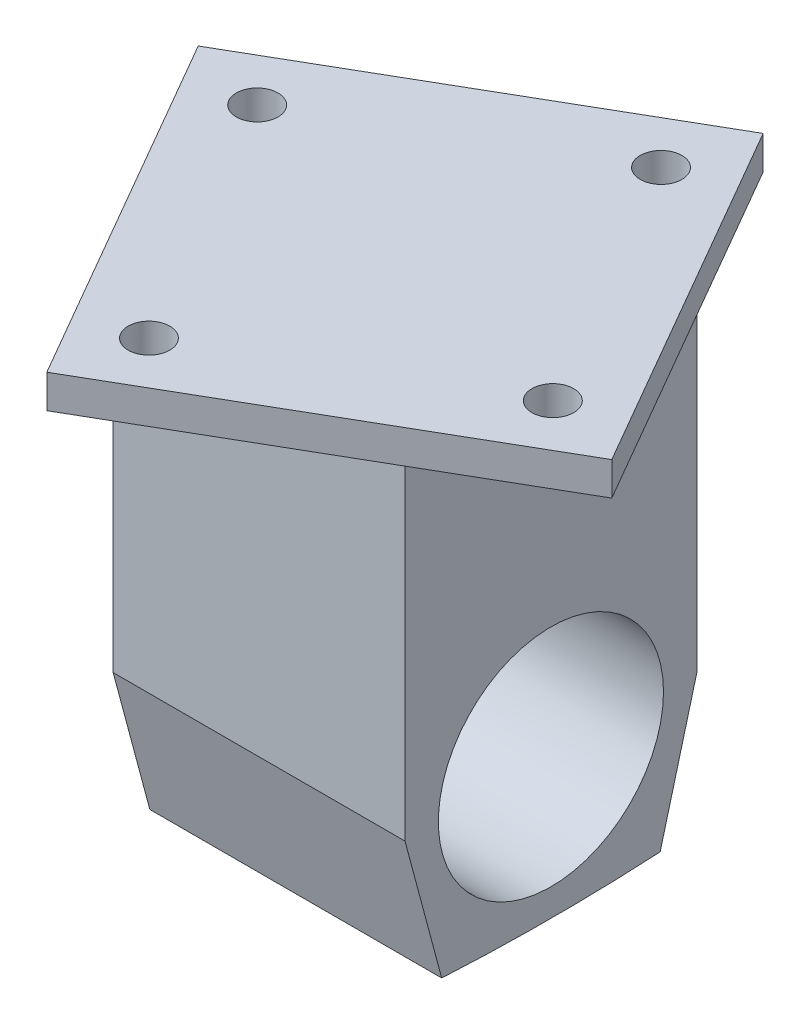
ISO-10303-21;
HEADER;
FILE_DESCRIPTION(('STEP AP214'),'2;1');
FILE_NAME('part.step','',(''),(''),'','','');
FILE_SCHEMA(('AUTOMOTIVE_DESIGN { 1 0 10303 214 1 1 1 1 }'));
ENDSEC;
DATA;
#1=APPLICATION_CONTEXT('core data for automotive mechanical design processes');
#2=APPLICATION_PROTOCOL_DEFINITION('international standard','automotive_design',2000,#1);
#3=PRODUCT_CONTEXT('',#1,'mechanical');
#4=PRODUCT('Part','Part','',(#3));
#5=PRODUCT_RELATED_PRODUCT_CATEGORY('part','',(#4));
#6=PRODUCT_DEFINITION_FORMATION('','',#4);
#7=PRODUCT_DEFINITION_CONTEXT('part definition',#1,'design');
#8=PRODUCT_DEFINITION('design','',#6,#7);
#9=PRODUCT_DEFINITION_SHAPE('','',#8);
#10=(LENGTH_UNIT() NAMED_UNIT(*) SI_UNIT(.MILLI.,.METRE.));
#11=(NAMED_UNIT(*) PLANE_ANGLE_UNIT() SI_UNIT($,.RADIAN.));
#12=(NAMED_UNIT(*) SI_UNIT($,.STERADIAN.) SOLID_ANGLE_UNIT());
#13=UNCERTAINTY_MEASURE_WITH_UNIT(LENGTH_MEASURE(1.E-05),#10,'distance_accuracy_value','');
#14=(GEOMETRIC_REPRESENTATION_CONTEXT(3) GLOBAL_UNCERTAINTY_ASSIGNED_CONTEXT((#13)) GLOBAL_UNIT_ASSIGNED_CONTEXT((#10,
#11,#12)) REPRESENTATION_CONTEXT('',''));
#15=CARTESIAN_POINT('',(0.,0.,0.));
#16=DIRECTION('',(0.,0.,1.));
#17=DIRECTION('',(1.,0.,0.));
#18=AXIS2_PLACEMENT_3D('',#15,#16,#17);
#19=CARTESIAN_POINT('',(22.225,50.292,22.225));
#20=DIRECTION('',(-1.,0.,0.));
#21=DIRECTION('',(0.,0.,1.));
#22=AXIS2_PLACEMENT_3D('',#19,#20,#21);
#23=PLANE('',#22);
#24=CARTESIAN_POINT('',(22.225,0.,0.));
#25=DIRECTION('',(1.,0.,0.));
#26=DIRECTION('',(0.,0.,-1.));
#27=AXIS2_PLACEMENT_3D('',#24,#25,#26);
#28=CIRCLE('',#27,17.145);
#29=CARTESIAN_POINT('',(22.225,0.,-17.145));
#30=VERTEX_POINT('',#29);
#31=EDGE_CURVE('E132',#30,#30,#28,.T.);
#32=ORIENTED_EDGE('',*,*,#31,.F.);
#33=EDGE_LOOP('',(#32));
#34=FACE_BOUND('',#33,.T.);
#35=DIRECTION('',(0.,-1.,0.));
#36=VECTOR('',#35,1.);
#37=CARTESIAN_POINT('',(22.225,50.292,22.225));
#38=LINE('',#37,#36);
#39=CARTESIAN_POINT('',(22.225,50.292,22.225));
#40=VERTEX_POINT('',#39);
#41=CARTESIAN_POINT('',(22.225,0.,22.225));
#42=VERTEX_POINT('',#41);
#43=EDGE_CURVE('E175',#40,#42,#38,.T.);
#44=ORIENTED_EDGE('',*,*,#43,.T.);
#45=DIRECTION('',(0.,-0.965925826289069,-0.258819045102518));
#46=VECTOR('',#45,1.);
#47=CARTESIAN_POINT('',(22.225,0.,22.225));
#48=LINE('',#47,#46);
#49=CARTESIAN_POINT('',(22.225,-20.854338589581,16.6370968162366));
#50=VERTEX_POINT('',#49);
#51=EDGE_CURVE('E144',#42,#50,#48,.T.);
#52=ORIENTED_EDGE('',*,*,#51,.T.);
#53=CARTESIAN_POINT('',(22.225,278.671939216944,4.44089209850063E-13));
#54=DIRECTION('',(-1.,0.,0.));
#55=DIRECTION('',(0.,0.,1.));
#56=AXIS2_PLACEMENT_3D('',#53,#54,#55);
#57=CIRCLE('',#56,299.987973237435);
#58=CARTESIAN_POINT('',(22.225,-20.854338589581,-16.6370968162367));
#59=VERTEX_POINT('',#58);
#60=EDGE_CURVE('E152',#59,#50,#57,.T.);
#61=ORIENTED_EDGE('',*,*,#60,.F.);
#62=DIRECTION('',(0.,-0.965925826289067,0.258819045102525));
#63=VECTOR('',#62,1.);
#64=CARTESIAN_POINT('',(22.225,0.,-22.225));
#65=LINE('',#64,#63);
#66=CARTESIAN_POINT('',(22.225,0.,-22.225));
#67=VERTEX_POINT('',#66);
#68=EDGE_CURVE('E150',#67,#59,#65,.T.);
#69=ORIENTED_EDGE('',*,*,#68,.F.);
#70=DIRECTION('',(0.,-1.,0.));
#71=VECTOR('',#70,1.);
#72=CARTESIAN_POINT('',(22.225,50.292,-22.225));
#73=LINE('',#72,#71);
#74=CARTESIAN_POINT('',(22.225,50.292,-22.225));
#75=VERTEX_POINT('',#74);
#76=EDGE_CURVE('E11',#75,#67,#73,.T.);
#77=ORIENTED_EDGE('',*,*,#76,.F.);
#78=DIRECTION('',(0.,0.,-1.));
#79=VECTOR('',#78,1.);
#80=CARTESIAN_POINT('',(22.225,50.292,22.225));
#81=LINE('',#80,#79);
#82=EDGE_CURVE('E162',#40,#75,#81,.T.);
#83=ORIENTED_EDGE('',*,*,#82,.F.);
#84=EDGE_LOOP('',(#44,#52,#61,#69,#77,#83));
#85=FACE_BOUND('',#84,.T.);
#86=ADVANCED_FACE('F32',(#34,#85),#23,.F.);
#87=CARTESIAN_POINT('',(-22.225,50.292,-22.225));
#88=DIRECTION('',(0.,0.,1.));
#89=DIRECTION('',(1.,0.,0.));
#90=AXIS2_PLACEMENT_3D('',#87,#88,#89);
#91=PLANE('',#90);
#92=DIRECTION('',(-1.,0.,0.));
#93=VECTOR('',#92,1.);
#94=CARTESIAN_POINT('',(-22.225,0.,-22.225));
#95=LINE('',#94,#93);
#96=CARTESIAN_POINT('',(-22.225,0.,-22.225));
#97=VERTEX_POINT('',#96);
#98=EDGE_CURVE('E161',#67,#97,#95,.T.);
#99=ORIENTED_EDGE('',*,*,#98,.T.);
#100=DIRECTION('',(0.,-1.,0.));
#101=VECTOR('',#100,1.);
#102=CARTESIAN_POINT('',(-22.225,50.292,-22.225));
#103=LINE('',#102,#101);
#104=CARTESIAN_POINT('',(-22.225,50.292,-22.225));
#105=VERTEX_POINT('',#104);
#106=EDGE_CURVE('E41',#105,#97,#103,.T.);
#107=ORIENTED_EDGE('',*,*,#106,.F.);
#108=DIRECTION('',(-1.,0.,0.));
#109=VECTOR('',#108,1.);
#110=CARTESIAN_POINT('',(-22.225,50.292,-22.225));
#111=LINE('',#110,#109);
#112=EDGE_CURVE('E165',#75,#105,#111,.T.);
#113=ORIENTED_EDGE('',*,*,#112,.F.);
#114=ORIENTED_EDGE('',*,*,#76,.T.);
#115=EDGE_LOOP('',(#99,#107,#113,#114));
#116=FACE_BOUND('',#115,.T.);
#117=ADVANCED_FACE('F259',(#116),#91,.F.);
#118=CARTESIAN_POINT('',(-22.225,50.292,22.225));
#119=DIRECTION('',(1.,0.,0.));
#120=DIRECTION('',(0.,0.,-1.));
#121=AXIS2_PLACEMENT_3D('',#118,#119,#120);
#122=PLANE('',#121);
#123=CARTESIAN_POINT('',(-22.225,0.,0.));
#124=DIRECTION('',(1.,0.,0.));
#125=DIRECTION('',(0.,0.,-1.));
#126=AXIS2_PLACEMENT_3D('',#123,#124,#125);
#127=CIRCLE('',#126,17.145);
#128=CARTESIAN_POINT('',(-22.225,0.,-17.145));
#129=VERTEX_POINT('',#128);
#130=EDGE_CURVE('E135',#129,#129,#127,.T.);
#131=ORIENTED_EDGE('',*,*,#130,.T.);
#132=EDGE_LOOP('',(#131));
#133=FACE_BOUND('',#132,.T.);
#134=ORIENTED_EDGE('',*,*,#106,.T.);
#135=DIRECTION('',(0.,-0.965925826289067,0.258819045102525));
#136=VECTOR('',#135,1.);
#137=CARTESIAN_POINT('',(-22.225,0.,-22.225));
#138=LINE('',#137,#136);
#139=CARTESIAN_POINT('',(-22.225,-20.854338589581,-16.6370968162367));
#140=VERTEX_POINT('',#139);
#141=EDGE_CURVE('E141',#97,#140,#138,.T.);
#142=ORIENTED_EDGE('',*,*,#141,.T.);
#143=CARTESIAN_POINT('',(-22.225,278.671939216944,4.44089209850063E-13));
#144=DIRECTION('',(-1.,0.,0.));
#145=DIRECTION('',(0.,0.,1.));
#146=AXIS2_PLACEMENT_3D('',#143,#144,#145);
#147=CIRCLE('',#146,299.987973237435);
#148=CARTESIAN_POINT('',(-22.225,-20.854338589581,16.6370968162366));
#149=VERTEX_POINT('',#148);
#150=EDGE_CURVE('E143',#140,#149,#147,.T.);
#151=ORIENTED_EDGE('',*,*,#150,.T.);
#152=DIRECTION('',(0.,-0.965925826289069,-0.258819045102518));
#153=VECTOR('',#152,1.);
#154=CARTESIAN_POINT('',(-22.225,0.,22.225));
#155=LINE('',#154,#153);
#156=CARTESIAN_POINT('',(-22.225,0.,22.225));
#157=VERTEX_POINT('',#156);
#158=EDGE_CURVE('E146',#157,#149,#155,.T.);
#159=ORIENTED_EDGE('',*,*,#158,.F.);
#160=DIRECTION('',(0.,-1.,0.));
#161=VECTOR('',#160,1.);
#162=CARTESIAN_POINT('',(-22.225,50.292,22.225));
#163=LINE('',#162,#161);
#164=CARTESIAN_POINT('',(-22.225,50.292,22.225));
#165=VERTEX_POINT('',#164);
#166=EDGE_CURVE('E49',#165,#157,#163,.T.);
#167=ORIENTED_EDGE('',*,*,#166,.F.);
#168=DIRECTION('',(0.,0.,1.));
#169=VECTOR('',#168,1.);
#170=CARTESIAN_POINT('',(-22.225,50.292,22.225));
#171=LINE('',#170,#169);
#172=EDGE_CURVE('E169',#105,#165,#171,.T.);
#173=ORIENTED_EDGE('',*,*,#172,.F.);
#174=EDGE_LOOP('',(#134,#142,#151,#159,#167,#173));
#175=FACE_BOUND('',#174,.T.);
#176=ADVANCED_FACE('F264',(#133,#175),#122,.F.);
#177=CARTESIAN_POINT('',(-22.225,50.292,22.225));
#178=DIRECTION('',(0.,0.,-1.));
#179=DIRECTION('',(-1.,0.,0.));
#180=AXIS2_PLACEMENT_3D('',#177,#178,#179);
#181=PLANE('',#180);
#182=DIRECTION('',(1.,0.,0.));
#183=VECTOR('',#182,1.);
#184=CARTESIAN_POINT('',(-22.225,0.,22.225));
#185=LINE('',#184,#183);
#186=EDGE_CURVE('E166',#157,#42,#185,.T.);
#187=ORIENTED_EDGE('',*,*,#186,.T.);
#188=ORIENTED_EDGE('',*,*,#43,.F.);
#189=DIRECTION('',(1.,0.,0.));
#190=VECTOR('',#189,1.);
#191=CARTESIAN_POINT('',(-22.225,50.292,22.225));
#192=LINE('',#191,#190);
#193=EDGE_CURVE('E172',#165,#40,#192,.T.);
#194=ORIENTED_EDGE('',*,*,#193,.F.);
#195=ORIENTED_EDGE('',*,*,#166,.T.);
#196=EDGE_LOOP('',(#187,#188,#194,#195));
#197=FACE_BOUND('',#196,.T.);
#198=ADVANCED_FACE('F272',(#197),#181,.F.);
#199=CARTESIAN_POINT('',(-22.225,0.,-22.225));
#200=DIRECTION('',(0.,0.258819045102525,0.965925826289067));
#201=DIRECTION('',(0.,-0.965925826289067,0.258819045102525));
#202=AXIS2_PLACEMENT_3D('',#199,#200,#201);
#203=PLANE('',#202);
#204=ORIENTED_EDGE('',*,*,#68,.T.);
#205=DIRECTION('',(1.,0.,0.));
#206=VECTOR('',#205,1.);
#207=CARTESIAN_POINT('',(-22.225,-20.854338589581,-16.6370968162367));
#208=LINE('',#207,#206);
#209=EDGE_CURVE('E158',#140,#59,#208,.T.);
#210=ORIENTED_EDGE('',*,*,#209,.F.);
#211=ORIENTED_EDGE('',*,*,#141,.F.);
#212=ORIENTED_EDGE('',*,*,#98,.F.);
#213=EDGE_LOOP('',(#204,#210,#211,#212));
#214=FACE_BOUND('',#213,.T.);
#215=ADVANCED_FACE('F278',(#214),#203,.F.);
#216=CARTESIAN_POINT('',(-22.225,278.671939216944,4.44089209850063E-13));
#217=DIRECTION('',(1.,0.,0.));
#218=DIRECTION('',(0.,0.,-1.));
#219=AXIS2_PLACEMENT_3D('',#216,#217,#218);
#220=CYLINDRICAL_SURFACE('',#219,299.987973237435);
#221=ORIENTED_EDGE('',*,*,#60,.T.);
#222=DIRECTION('',(1.,0.,0.));
#223=VECTOR('',#222,1.);
#224=CARTESIAN_POINT('',(-22.225,-20.854338589581,16.6370968162366));
#225=LINE('',#224,#223);
#226=EDGE_CURVE('E149',#149,#50,#225,.T.);
#227=ORIENTED_EDGE('',*,*,#226,.F.);
#228=ORIENTED_EDGE('',*,*,#150,.F.);
#229=ORIENTED_EDGE('',*,*,#209,.T.);
#230=EDGE_LOOP('',(#221,#227,#228,#229));
#231=FACE_BOUND('',#230,.T.);
#232=ADVANCED_FACE('F282',(#231),#220,.T.);
#233=CARTESIAN_POINT('',(-22.225,0.,22.225));
#234=DIRECTION('',(0.,-0.258819045102518,0.965925826289069));
#235=DIRECTION('',(0.,-0.965925826289069,-0.258819045102518));
#236=AXIS2_PLACEMENT_3D('',#233,#234,#235);
#237=PLANE('',#236);
#238=ORIENTED_EDGE('',*,*,#51,.F.);
#239=ORIENTED_EDGE('',*,*,#186,.F.);
#240=ORIENTED_EDGE('',*,*,#158,.T.);
#241=ORIENTED_EDGE('',*,*,#226,.T.);
#242=EDGE_LOOP('',(#238,#239,#240,#241));
#243=FACE_BOUND('',#242,.T.);
#244=ADVANCED_FACE('F284',(#243),#237,.T.);
#245=CARTESIAN_POINT('',(-104.775,0.,0.));
#246=DIRECTION('',(1.,0.,0.));
#247=DIRECTION('',(0.,0.,-1.));
#248=AXIS2_PLACEMENT_3D('',#245,#246,#247);
#249=CYLINDRICAL_SURFACE('',#248,17.145);
#250=ORIENTED_EDGE('',*,*,#31,.T.);
#251=EDGE_LOOP('',(#250));
#252=FACE_BOUND('',#251,.T.);
#253=ORIENTED_EDGE('',*,*,#130,.F.);
#254=EDGE_LOOP('',(#253));
#255=FACE_BOUND('',#254,.T.);
#256=ADVANCED_FACE('F286',(#252,#255),#249,.F.);
#257=CARTESIAN_POINT('',(11.5283361175947,55.372,-43.0243361175947));
#258=DIRECTION('',(-0.866025403784439,0.,0.5));
#259=DIRECTION('',(0.5,0.,0.866025403784439));
#260=AXIS2_PLACEMENT_3D('',#257,#258,#259);
#261=PLANE('',#260);
#262=DIRECTION('',(-0.5,0.,-0.866025403784439));
#263=VECTOR('',#262,1.);
#264=CARTESIAN_POINT('',(11.5283361175947,50.292,-43.0243361175947));
#265=LINE('',#264,#263);
#266=CARTESIAN_POINT('',(43.0243361175947,50.292,11.5283361175947));
#267=VERTEX_POINT('',#266);
#268=CARTESIAN_POINT('',(11.5283361175947,50.292,-43.0243361175947));
#269=VERTEX_POINT('',#268);
#270=EDGE_CURVE('E131',#267,#269,#265,.T.);
#271=ORIENTED_EDGE('',*,*,#270,.T.);
#272=DIRECTION('',(0.,-1.,0.));
#273=VECTOR('',#272,1.);
#274=CARTESIAN_POINT('',(11.5283361175947,55.372,-43.0243361175947));
#275=LINE('',#274,#273);
#276=CARTESIAN_POINT('',(11.5283361175947,55.372,-43.0243361175947));
#277=VERTEX_POINT('',#276);
#278=EDGE_CURVE('E111',#277,#269,#275,.T.);
#279=ORIENTED_EDGE('',*,*,#278,.F.);
#280=DIRECTION('',(-0.5,0.,-0.866025403784439));
#281=VECTOR('',#280,1.);
#282=CARTESIAN_POINT('',(11.5283361175947,55.372,-43.0243361175947));
#283=LINE('',#282,#281);
#284=CARTESIAN_POINT('',(43.0243361175947,55.372,11.5283361175947));
#285=VERTEX_POINT('',#284);
#286=EDGE_CURVE('E118',#285,#277,#283,.T.);
#287=ORIENTED_EDGE('',*,*,#286,.F.);
#288=DIRECTION('',(0.,-1.,0.));
#289=VECTOR('',#288,1.);
#290=CARTESIAN_POINT('',(43.0243361175947,55.372,11.5283361175947));
#291=LINE('',#290,#289);
#292=EDGE_CURVE('E209',#285,#267,#291,.T.);
#293=ORIENTED_EDGE('',*,*,#292,.T.);
#294=EDGE_LOOP('',(#271,#279,#287,#293));
#295=FACE_BOUND('',#294,.T.);
#296=ADVANCED_FACE('F129',(#295),#261,.F.);
#297=CARTESIAN_POINT('',(-43.0243361175947,55.372,-11.5283361175947));
#298=DIRECTION('',(0.5,0.,0.866025403784439));
#299=DIRECTION('',(0.866025403784439,0.,-0.5));
#300=AXIS2_PLACEMENT_3D('',#297,#298,#299);
#301=PLANE('',#300);
#302=DIRECTION('',(-0.866025403784439,0.,0.5));
#303=VECTOR('',#302,1.);
#304=CARTESIAN_POINT('',(-43.0243361175947,50.292,-11.5283361175947));
#305=LINE('',#304,#303);
#306=CARTESIAN_POINT('',(-43.0243361175947,50.292,-11.5283361175947));
#307=VERTEX_POINT('',#306);
#308=EDGE_CURVE('E200',#269,#307,#305,.T.);
#309=ORIENTED_EDGE('',*,*,#308,.T.);
#310=DIRECTION('',(0.,-1.,0.));
#311=VECTOR('',#310,1.);
#312=CARTESIAN_POINT('',(-43.0243361175947,55.372,-11.5283361175947));
#313=LINE('',#312,#311);
#314=CARTESIAN_POINT('',(-43.0243361175947,55.372,-11.5283361175947));
#315=VERTEX_POINT('',#314);
#316=EDGE_CURVE('E114',#315,#307,#313,.T.);
#317=ORIENTED_EDGE('',*,*,#316,.F.);
#318=DIRECTION('',(-0.866025403784439,0.,0.5));
#319=VECTOR('',#318,1.);
#320=CARTESIAN_POINT('',(-43.0243361175947,55.372,-11.5283361175947));
#321=LINE('',#320,#319);
#322=EDGE_CURVE('E107',#277,#315,#321,.T.);
#323=ORIENTED_EDGE('',*,*,#322,.F.);
#324=ORIENTED_EDGE('',*,*,#278,.T.);
#325=EDGE_LOOP('',(#309,#317,#323,#324));
#326=FACE_BOUND('',#325,.T.);
#327=ADVANCED_FACE('F109',(#326),#301,.F.);
#328=CARTESIAN_POINT('',(-11.5283361175947,55.372,43.0243361175947));
#329=DIRECTION('',(0.866025403784439,0.,-0.5));
#330=DIRECTION('',(-0.5,0.,-0.866025403784439));
#331=AXIS2_PLACEMENT_3D('',#328,#329,#330);
#332=PLANE('',#331);
#333=DIRECTION('',(0.5,0.,0.866025403784439));
#334=VECTOR('',#333,1.);
#335=CARTESIAN_POINT('',(-11.5283361175947,50.292,43.0243361175947));
#336=LINE('',#335,#334);
#337=CARTESIAN_POINT('',(-11.5283361175947,50.292,43.0243361175947));
#338=VERTEX_POINT('',#337);
#339=EDGE_CURVE('E202',#307,#338,#336,.T.);
#340=ORIENTED_EDGE('',*,*,#339,.T.);
#341=DIRECTION('',(0.,-1.,0.));
#342=VECTOR('',#341,1.);
#343=CARTESIAN_POINT('',(-11.5283361175947,55.372,43.0243361175947));
#344=LINE('',#343,#342);
#345=CARTESIAN_POINT('',(-11.5283361175947,55.372,43.0243361175947));
#346=VERTEX_POINT('',#345);
#347=EDGE_CURVE('E137',#346,#338,#344,.T.);
#348=ORIENTED_EDGE('',*,*,#347,.F.);
#349=DIRECTION('',(0.5,0.,0.866025403784439));
#350=VECTOR('',#349,1.);
#351=CARTESIAN_POINT('',(-11.5283361175947,55.372,43.0243361175947));
#352=LINE('',#351,#350);
#353=EDGE_CURVE('E117',#315,#346,#352,.T.);
#354=ORIENTED_EDGE('',*,*,#353,.F.);
#355=ORIENTED_EDGE('',*,*,#316,.T.);
#356=EDGE_LOOP('',(#340,#348,#354,#355));
#357=FACE_BOUND('',#356,.T.);
#358=ADVANCED_FACE('F219',(#357),#332,.F.);
#359=CARTESIAN_POINT('',(43.0243361175947,55.372,11.5283361175947));
#360=DIRECTION('',(-0.5,0.,-0.866025403784439));
#361=DIRECTION('',(-0.866025403784439,0.,0.5));
#362=AXIS2_PLACEMENT_3D('',#359,#360,#361);
#363=PLANE('',#362);
#364=DIRECTION('',(0.866025403784439,0.,-0.5));
#365=VECTOR('',#364,1.);
#366=CARTESIAN_POINT('',(43.0243361175947,50.292,11.5283361175947));
#367=LINE('',#366,#365);
#368=EDGE_CURVE('E127',#338,#267,#367,.T.);
#369=ORIENTED_EDGE('',*,*,#368,.T.);
#370=ORIENTED_EDGE('',*,*,#292,.F.);
#371=DIRECTION('',(0.866025403784439,0.,-0.5));
#372=VECTOR('',#371,1.);
#373=CARTESIAN_POINT('',(43.0243361175947,55.372,11.5283361175947));
#374=LINE('',#373,#372);
#375=EDGE_CURVE('E123',#346,#285,#374,.T.);
#376=ORIENTED_EDGE('',*,*,#375,.F.);
#377=ORIENTED_EDGE('',*,*,#347,.T.);
#378=EDGE_LOOP('',(#369,#370,#376,#377));
#379=FACE_BOUND('',#378,.T.);
#380=ADVANCED_FACE('F214',(#379),#363,.F.);
#381=CARTESIAN_POINT('',(0.,55.372,0.));
#382=DIRECTION('',(0.,-1.,0.));
#383=DIRECTION('',(0.,0.,-1.));
#384=AXIS2_PLACEMENT_3D('',#381,#382,#383);
#385=PLANE('',#384);
#386=CARTESIAN_POINT('',(30.7570781237235,55.372,8.24133424479262));
#387=DIRECTION('',(0.,1.,0.));
#388=DIRECTION('',(0.,0.,1.));
#389=AXIS2_PLACEMENT_3D('',#386,#387,#388);
#390=CIRCLE('',#389,3.175);
#391=CARTESIAN_POINT('',(30.7570781237235,55.372,11.4163342447926));
#392=VERTEX_POINT('',#391);
#393=EDGE_CURVE('E191',#392,#392,#390,.T.);
#394=ORIENTED_EDGE('',*,*,#393,.F.);
#395=EDGE_LOOP('',(#394));
#396=FACE_BOUND('',#395,.T.);
#397=CARTESIAN_POINT('',(-8.24133424479266,55.372,30.7570781237235));
#398=DIRECTION('',(0.,1.,0.));
#399=DIRECTION('',(0.,0.,1.));
#400=AXIS2_PLACEMENT_3D('',#397,#398,#399);
#401=CIRCLE('',#400,3.175);
#402=CARTESIAN_POINT('',(-8.24133424479266,55.372,33.9320781237235));
#403=VERTEX_POINT('',#402);
#404=EDGE_CURVE('E227',#403,#403,#401,.T.);
#405=ORIENTED_EDGE('',*,*,#404,.F.);
#406=EDGE_LOOP('',(#405));
#407=FACE_BOUND('',#406,.T.);
#408=CARTESIAN_POINT('',(8.24133424479261,55.372,-30.7570781237235));
#409=DIRECTION('',(0.,1.,0.));
#410=DIRECTION('',(0.,0.,-1.));
#411=AXIS2_PLACEMENT_3D('',#408,#409,#410);
#412=CIRCLE('',#411,3.175);
#413=CARTESIAN_POINT('',(8.24133424479261,55.372,-33.9320781237235));
#414=VERTEX_POINT('',#413);
#415=EDGE_CURVE('E224',#414,#414,#412,.T.);
#416=ORIENTED_EDGE('',*,*,#415,.F.);
#417=EDGE_LOOP('',(#416));
#418=FACE_BOUND('',#417,.T.);
#419=CARTESIAN_POINT('',(-30.7570781237235,55.372,-8.24133424479265));
#420=DIRECTION('',(0.,1.,0.));
#421=DIRECTION('',(0.,0.,-1.));
#422=AXIS2_PLACEMENT_3D('',#419,#420,#421);
#423=CIRCLE('',#422,3.175);
#424=CARTESIAN_POINT('',(-30.7570781237235,55.372,-11.4163342447926));
#425=VERTEX_POINT('',#424);
#426=EDGE_CURVE('E221',#425,#425,#423,.T.);
#427=ORIENTED_EDGE('',*,*,#426,.F.);
#428=EDGE_LOOP('',(#427));
#429=FACE_BOUND('',#428,.T.);
#430=ORIENTED_EDGE('',*,*,#286,.T.);
#431=ORIENTED_EDGE('',*,*,#322,.T.);
#432=ORIENTED_EDGE('',*,*,#353,.T.);
#433=ORIENTED_EDGE('',*,*,#375,.T.);
#434=EDGE_LOOP('',(#430,#431,#432,#433));
#435=FACE_BOUND('',#434,.T.);
#436=ADVANCED_FACE('F121',(#396,#407,#418,#429,#435),#385,.F.);
#437=CARTESIAN_POINT('',(0.,50.292,0.));
#438=DIRECTION('',(0.,-1.,0.));
#439=DIRECTION('',(0.,0.,-1.));
#440=AXIS2_PLACEMENT_3D('',#437,#438,#439);
#441=PLANE('',#440);
#442=CARTESIAN_POINT('',(30.7570781237235,50.292,8.24133424479262));
#443=DIRECTION('',(0.,-1.,0.));
#444=DIRECTION('',(0.,0.,-1.));
#445=AXIS2_PLACEMENT_3D('',#442,#443,#444);
#446=CIRCLE('',#445,3.175);
#447=CARTESIAN_POINT('',(30.7570781237235,50.292,5.06633424479262));
#448=VERTEX_POINT('',#447);
#449=EDGE_CURVE('E35',#448,#448,#446,.T.);
#450=ORIENTED_EDGE('',*,*,#449,.F.);
#451=EDGE_LOOP('',(#450));
#452=FACE_BOUND('',#451,.T.);
#453=CARTESIAN_POINT('',(-8.24133424479266,50.292,30.7570781237235));
#454=DIRECTION('',(0.,-1.,0.));
#455=DIRECTION('',(0.,0.,-1.));
#456=AXIS2_PLACEMENT_3D('',#453,#454,#455);
#457=CIRCLE('',#456,3.175);
#458=CARTESIAN_POINT('',(-8.24133424479266,50.292,27.5820781237235));
#459=VERTEX_POINT('',#458);
#460=EDGE_CURVE('E193',#459,#459,#457,.T.);
#461=ORIENTED_EDGE('',*,*,#460,.F.);
#462=EDGE_LOOP('',(#461));
#463=FACE_BOUND('',#462,.T.);
#464=CARTESIAN_POINT('',(8.24133424479261,50.292,-30.7570781237235));
#465=DIRECTION('',(0.,-1.,0.));
#466=DIRECTION('',(0.,0.,-1.));
#467=AXIS2_PLACEMENT_3D('',#464,#465,#466);
#468=CIRCLE('',#467,3.175);
#469=CARTESIAN_POINT('',(8.24133424479261,50.292,-33.9320781237235));
#470=VERTEX_POINT('',#469);
#471=EDGE_CURVE('E190',#470,#470,#468,.T.);
#472=ORIENTED_EDGE('',*,*,#471,.F.);
#473=EDGE_LOOP('',(#472));
#474=FACE_BOUND('',#473,.T.);
#475=CARTESIAN_POINT('',(-30.7570781237235,50.292,-8.24133424479265));
#476=DIRECTION('',(0.,-1.,0.));
#477=DIRECTION('',(0.,0.,-1.));
#478=AXIS2_PLACEMENT_3D('',#475,#476,#477);
#479=CIRCLE('',#478,3.175);
#480=CARTESIAN_POINT('',(-30.7570781237235,50.292,-11.4163342447926));
#481=VERTEX_POINT('',#480);
#482=EDGE_CURVE('E187',#481,#481,#479,.T.);
#483=ORIENTED_EDGE('',*,*,#482,.F.);
#484=EDGE_LOOP('',(#483));
#485=FACE_BOUND('',#484,.T.);
#486=ORIENTED_EDGE('',*,*,#193,.T.);
#487=ORIENTED_EDGE('',*,*,#82,.T.);
#488=ORIENTED_EDGE('',*,*,#112,.T.);
#489=ORIENTED_EDGE('',*,*,#172,.T.);
#490=EDGE_LOOP('',(#486,#487,#488,#489));
#491=FACE_BOUND('',#490,.T.);
#492=ORIENTED_EDGE('',*,*,#270,.F.);
#493=ORIENTED_EDGE('',*,*,#368,.F.);
#494=ORIENTED_EDGE('',*,*,#339,.F.);
#495=ORIENTED_EDGE('',*,*,#308,.F.);
#496=EDGE_LOOP('',(#492,#493,#494,#495));
#497=FACE_BOUND('',#496,.T.);
#498=ADVANCED_FACE('F218',(#452,#463,#474,#485,#491,#497),#441,.T.);
#499=CARTESIAN_POINT('',(-30.7570781237235,-21.3160340204917,-8.24133424479265));
#500=DIRECTION('',(0.,1.,0.));
#501=DIRECTION('',(0.,0.,1.));
#502=AXIS2_PLACEMENT_3D('',#499,#500,#501);
#503=CYLINDRICAL_SURFACE('',#502,3.175);
#504=ORIENTED_EDGE('',*,*,#482,.T.);
#505=EDGE_LOOP('',(#504));
#506=FACE_BOUND('',#505,.T.);
#507=ORIENTED_EDGE('',*,*,#426,.T.);
#508=EDGE_LOOP('',(#507));
#509=FACE_BOUND('',#508,.T.);
#510=ADVANCED_FACE('F244',(#506,#509),#503,.F.);
#511=CARTESIAN_POINT('',(8.24133424479261,-21.3160340204917,-30.7570781237235));
#512=DIRECTION('',(0.,1.,0.));
#513=DIRECTION('',(0.,0.,1.));
#514=AXIS2_PLACEMENT_3D('',#511,#512,#513);
#515=CYLINDRICAL_SURFACE('',#514,3.175);
#516=ORIENTED_EDGE('',*,*,#471,.T.);
#517=EDGE_LOOP('',(#516));
#518=FACE_BOUND('',#517,.T.);
#519=ORIENTED_EDGE('',*,*,#415,.T.);
#520=EDGE_LOOP('',(#519));
#521=FACE_BOUND('',#520,.T.);
#522=ADVANCED_FACE('F246',(#518,#521),#515,.F.);
#523=CARTESIAN_POINT('',(-8.24133424479266,-21.3160340204917,30.7570781237235));
#524=DIRECTION('',(0.,1.,0.));
#525=DIRECTION('',(0.,0.,1.));
#526=AXIS2_PLACEMENT_3D('',#523,#524,#525);
#527=CYLINDRICAL_SURFACE('',#526,3.175);
#528=ORIENTED_EDGE('',*,*,#460,.T.);
#529=EDGE_LOOP('',(#528));
#530=FACE_BOUND('',#529,.T.);
#531=ORIENTED_EDGE('',*,*,#404,.T.);
#532=EDGE_LOOP('',(#531));
#533=FACE_BOUND('',#532,.T.);
#534=ADVANCED_FACE('F253',(#530,#533),#527,.F.);
#535=CARTESIAN_POINT('',(30.7570781237235,-21.3160340204917,8.24133424479262));
#536=DIRECTION('',(0.,1.,0.));
#537=DIRECTION('',(0.,0.,1.));
#538=AXIS2_PLACEMENT_3D('',#535,#536,#537);
#539=CYLINDRICAL_SURFACE('',#538,3.175);
#540=ORIENTED_EDGE('',*,*,#449,.T.);
#541=EDGE_LOOP('',(#540));
#542=FACE_BOUND('',#541,.T.);
#543=ORIENTED_EDGE('',*,*,#393,.T.);
#544=EDGE_LOOP('',(#543));
#545=FACE_BOUND('',#544,.T.);
#546=ADVANCED_FACE('F233',(#542,#545),#539,.F.);
#547=CLOSED_SHELL('',(#86,#117,#176,#198,#215,#232,#244,#256,#296,#327,#358,#380,#436,#498,#510,
#522,#534,#546));
#548=MANIFOLD_SOLID_BREP('B2',#547);
#549=ADVANCED_BREP_SHAPE_REPRESENTATION('',(#18,#548),#14);
#550=SHAPE_DEFINITION_REPRESENTATION(#9,#549);
ENDSEC;
END-ISO-10303-21;
